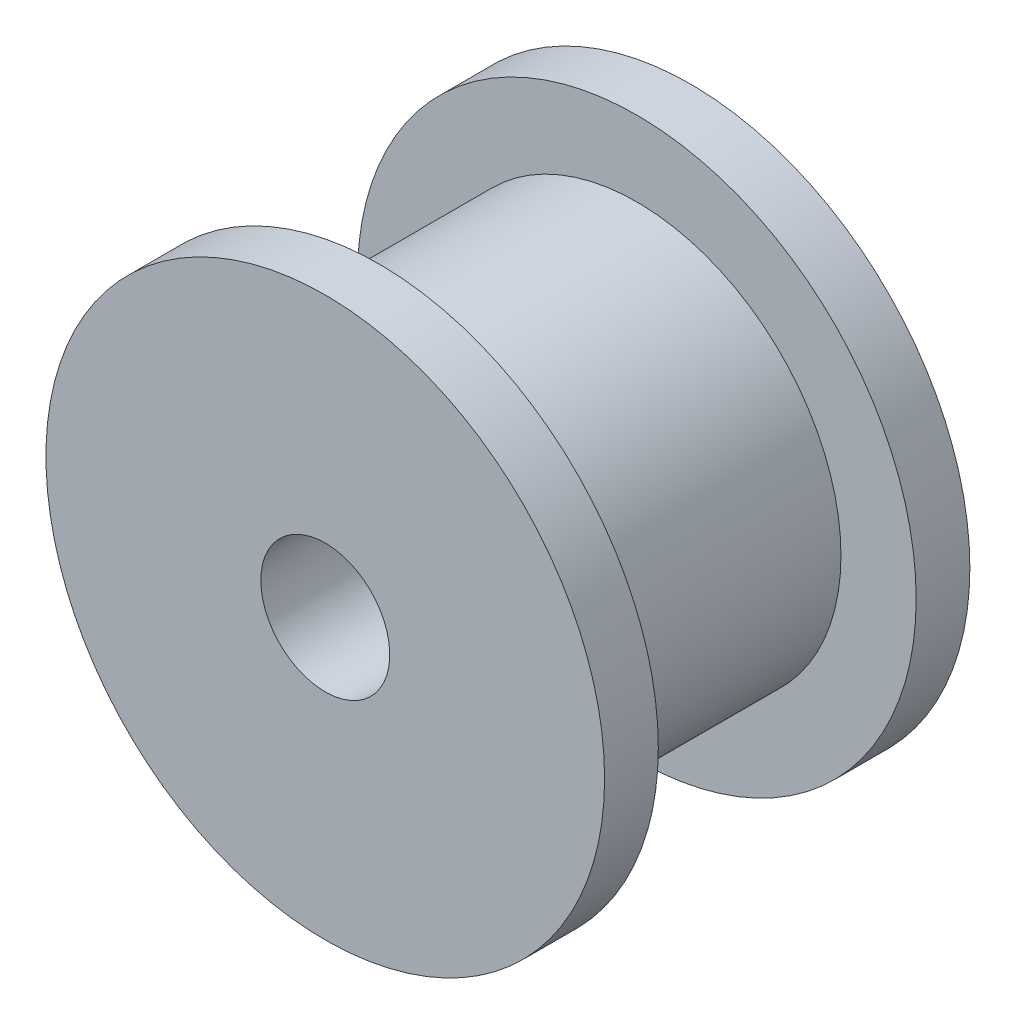
ISO-10303-21;
HEADER;
FILE_DESCRIPTION(('STEP AP214'),'2;1');
FILE_NAME('part.step','',(''),(''),'','','');
FILE_SCHEMA(('AUTOMOTIVE_DESIGN { 1 0 10303 214 1 1 1 1 }'));
ENDSEC;
DATA;
#1=APPLICATION_CONTEXT('core data for automotive mechanical design processes');
#2=APPLICATION_PROTOCOL_DEFINITION('international standard','automotive_design',2000,#1);
#3=PRODUCT_CONTEXT('',#1,'mechanical');
#4=PRODUCT('Part','Part','',(#3));
#5=PRODUCT_RELATED_PRODUCT_CATEGORY('part','',(#4));
#6=PRODUCT_DEFINITION_FORMATION('','',#4);
#7=PRODUCT_DEFINITION_CONTEXT('part definition',#1,'design');
#8=PRODUCT_DEFINITION('design','',#6,#7);
#9=PRODUCT_DEFINITION_SHAPE('','',#8);
#10=(LENGTH_UNIT() NAMED_UNIT(*) SI_UNIT(.MILLI.,.METRE.));
#11=(NAMED_UNIT(*) PLANE_ANGLE_UNIT() SI_UNIT($,.RADIAN.));
#12=(NAMED_UNIT(*) SI_UNIT($,.STERADIAN.) SOLID_ANGLE_UNIT());
#13=UNCERTAINTY_MEASURE_WITH_UNIT(LENGTH_MEASURE(1.E-05),#10,'distance_accuracy_value','');
#14=(GEOMETRIC_REPRESENTATION_CONTEXT(3) GLOBAL_UNCERTAINTY_ASSIGNED_CONTEXT((#13)) GLOBAL_UNIT_ASSIGNED_CONTEXT((#10,
#11,#12)) REPRESENTATION_CONTEXT('',''));
#15=CARTESIAN_POINT('',(0.,0.,0.));
#16=DIRECTION('',(0.,0.,1.));
#17=DIRECTION('',(1.,0.,0.));
#18=AXIS2_PLACEMENT_3D('',#15,#16,#17);
#19=CARTESIAN_POINT('',(0.,0.,1.25));
#20=DIRECTION('',(0.,0.,-1.));
#21=DIRECTION('',(-1.,0.,0.));
#22=AXIS2_PLACEMENT_3D('',#19,#20,#21);
#23=CYLINDRICAL_SURFACE('',#22,6.5);
#24=CARTESIAN_POINT('',(0.,0.,1.25));
#25=DIRECTION('',(0.,0.,1.));
#26=DIRECTION('',(1.,0.,0.));
#27=AXIS2_PLACEMENT_3D('',#24,#25,#26);
#28=CIRCLE('',#27,6.5);
#29=CARTESIAN_POINT('',(6.5,0.,1.25));
#30=VERTEX_POINT('',#29);
#31=EDGE_CURVE('E44',#30,#30,#28,.T.);
#32=ORIENTED_EDGE('',*,*,#31,.F.);
#33=EDGE_LOOP('',(#32));
#34=FACE_BOUND('',#33,.T.);
#35=CARTESIAN_POINT('',(0.,0.,0.));
#36=DIRECTION('',(0.,0.,1.));
#37=DIRECTION('',(1.,0.,0.));
#38=AXIS2_PLACEMENT_3D('',#35,#36,#37);
#39=CIRCLE('',#38,6.5);
#40=CARTESIAN_POINT('',(6.5,0.,0.));
#41=VERTEX_POINT('',#40);
#42=EDGE_CURVE('E39',#41,#41,#39,.T.);
#43=ORIENTED_EDGE('',*,*,#42,.T.);
#44=EDGE_LOOP('',(#43));
#45=FACE_BOUND('',#44,.T.);
#46=ADVANCED_FACE('F36',(#34,#45),#23,.T.);
#47=CARTESIAN_POINT('',(0.,0.,1.25));
#48=DIRECTION('',(0.,0.,1.));
#49=DIRECTION('',(1.,0.,0.));
#50=AXIS2_PLACEMENT_3D('',#47,#48,#49);
#51=PLANE('',#50);
#52=CARTESIAN_POINT('',(0.,0.,1.25));
#53=DIRECTION('',(0.,0.,1.));
#54=DIRECTION('',(1.,0.,0.));
#55=AXIS2_PLACEMENT_3D('',#52,#53,#54);
#56=CIRCLE('',#55,4.75);
#57=CARTESIAN_POINT('',(4.75,0.,1.25));
#58=VERTEX_POINT('',#57);
#59=EDGE_CURVE('E10',#58,#58,#56,.T.);
#60=ORIENTED_EDGE('',*,*,#59,.F.);
#61=EDGE_LOOP('',(#60));
#62=FACE_BOUND('',#61,.T.);
#63=ORIENTED_EDGE('',*,*,#31,.T.);
#64=EDGE_LOOP('',(#63));
#65=FACE_BOUND('',#64,.T.);
#66=ADVANCED_FACE('F86',(#62,#65),#51,.T.);
#67=CARTESIAN_POINT('',(0.,0.,0.));
#68=DIRECTION('',(0.,0.,1.));
#69=DIRECTION('',(1.,0.,0.));
#70=AXIS2_PLACEMENT_3D('',#67,#68,#69);
#71=PLANE('',#70);
#72=CARTESIAN_POINT('',(0.,0.,0.));
#73=DIRECTION('',(0.,0.,-1.));
#74=DIRECTION('',(-1.,0.,0.));
#75=AXIS2_PLACEMENT_3D('',#72,#73,#74);
#76=CIRCLE('',#75,1.5);
#77=CARTESIAN_POINT('',(-1.5,0.,0.));
#78=VERTEX_POINT('',#77);
#79=EDGE_CURVE('E64',#78,#78,#76,.T.);
#80=ORIENTED_EDGE('',*,*,#79,.F.);
#81=EDGE_LOOP('',(#80));
#82=FACE_BOUND('',#81,.T.);
#83=ORIENTED_EDGE('',*,*,#42,.F.);
#84=EDGE_LOOP('',(#83));
#85=FACE_BOUND('',#84,.T.);
#86=ADVANCED_FACE('F82',(#82,#85),#71,.F.);
#87=CARTESIAN_POINT('',(0.,0.,7.25));
#88=DIRECTION('',(0.,0.,-1.));
#89=DIRECTION('',(-1.,0.,0.));
#90=AXIS2_PLACEMENT_3D('',#87,#88,#89);
#91=CYLINDRICAL_SURFACE('',#90,4.75);
#92=CARTESIAN_POINT('',(0.,0.,7.25));
#93=DIRECTION('',(0.,0.,1.));
#94=DIRECTION('',(1.,0.,0.));
#95=AXIS2_PLACEMENT_3D('',#92,#93,#94);
#96=CIRCLE('',#95,4.75);
#97=CARTESIAN_POINT('',(4.75,0.,7.25));
#98=VERTEX_POINT('',#97);
#99=EDGE_CURVE('E51',#98,#98,#96,.T.);
#100=ORIENTED_EDGE('',*,*,#99,.F.);
#101=EDGE_LOOP('',(#100));
#102=FACE_BOUND('',#101,.T.);
#103=ORIENTED_EDGE('',*,*,#59,.T.);
#104=EDGE_LOOP('',(#103));
#105=FACE_BOUND('',#104,.T.);
#106=ADVANCED_FACE('F85',(#102,#105),#91,.T.);
#107=CARTESIAN_POINT('',(0.,0.,8.5));
#108=DIRECTION('',(0.,0.,-1.));
#109=DIRECTION('',(-1.,0.,0.));
#110=AXIS2_PLACEMENT_3D('',#107,#108,#109);
#111=CYLINDRICAL_SURFACE('',#110,6.5);
#112=CARTESIAN_POINT('',(0.,0.,8.5));
#113=DIRECTION('',(0.,0.,1.));
#114=DIRECTION('',(1.,0.,0.));
#115=AXIS2_PLACEMENT_3D('',#112,#113,#114);
#116=CIRCLE('',#115,6.5);
#117=CARTESIAN_POINT('',(6.5,0.,8.5));
#118=VERTEX_POINT('',#117);
#119=EDGE_CURVE('E55',#118,#118,#116,.T.);
#120=ORIENTED_EDGE('',*,*,#119,.F.);
#121=EDGE_LOOP('',(#120));
#122=FACE_BOUND('',#121,.T.);
#123=CARTESIAN_POINT('',(0.,0.,7.25));
#124=DIRECTION('',(0.,0.,1.));
#125=DIRECTION('',(1.,0.,0.));
#126=AXIS2_PLACEMENT_3D('',#123,#124,#125);
#127=CIRCLE('',#126,6.5);
#128=CARTESIAN_POINT('',(6.5,0.,7.25));
#129=VERTEX_POINT('',#128);
#130=EDGE_CURVE('E56',#129,#129,#127,.T.);
#131=ORIENTED_EDGE('',*,*,#130,.T.);
#132=EDGE_LOOP('',(#131));
#133=FACE_BOUND('',#132,.T.);
#134=ADVANCED_FACE('F106',(#122,#133),#111,.T.);
#135=CARTESIAN_POINT('',(0.,0.,8.5));
#136=DIRECTION('',(0.,0.,1.));
#137=DIRECTION('',(1.,0.,0.));
#138=AXIS2_PLACEMENT_3D('',#135,#136,#137);
#139=PLANE('',#138);
#140=CARTESIAN_POINT('',(0.,0.,8.5));
#141=DIRECTION('',(0.,0.,-1.));
#142=DIRECTION('',(-1.,0.,0.));
#143=AXIS2_PLACEMENT_3D('',#140,#141,#142);
#144=CIRCLE('',#143,1.5);
#145=CARTESIAN_POINT('',(-1.5,0.,8.5));
#146=VERTEX_POINT('',#145);
#147=EDGE_CURVE('E60',#146,#146,#144,.T.);
#148=ORIENTED_EDGE('',*,*,#147,.T.);
#149=EDGE_LOOP('',(#148));
#150=FACE_BOUND('',#149,.T.);
#151=ORIENTED_EDGE('',*,*,#119,.T.);
#152=EDGE_LOOP('',(#151));
#153=FACE_BOUND('',#152,.T.);
#154=ADVANCED_FACE('F72',(#150,#153),#139,.T.);
#155=CARTESIAN_POINT('',(0.,0.,7.25));
#156=DIRECTION('',(0.,0.,1.));
#157=DIRECTION('',(1.,0.,0.));
#158=AXIS2_PLACEMENT_3D('',#155,#156,#157);
#159=PLANE('',#158);
#160=ORIENTED_EDGE('',*,*,#99,.T.);
#161=EDGE_LOOP('',(#160));
#162=FACE_BOUND('',#161,.T.);
#163=ORIENTED_EDGE('',*,*,#130,.F.);
#164=EDGE_LOOP('',(#163));
#165=FACE_BOUND('',#164,.T.);
#166=ADVANCED_FACE('F78',(#162,#165),#159,.F.);
#167=CARTESIAN_POINT('',(0.,0.,8.5));
#168=DIRECTION('',(0.,0.,-1.));
#169=DIRECTION('',(-1.,0.,0.));
#170=AXIS2_PLACEMENT_3D('',#167,#168,#169);
#171=CYLINDRICAL_SURFACE('',#170,1.5);
#172=ORIENTED_EDGE('',*,*,#147,.F.);
#173=EDGE_LOOP('',(#172));
#174=FACE_BOUND('',#173,.T.);
#175=ORIENTED_EDGE('',*,*,#79,.T.);
#176=EDGE_LOOP('',(#175));
#177=FACE_BOUND('',#176,.T.);
#178=ADVANCED_FACE('F75',(#174,#177),#171,.F.);
#179=CLOSED_SHELL('',(#46,#66,#86,#106,#134,#154,#166,#178));
#180=MANIFOLD_SOLID_BREP('B2',#179);
#181=ADVANCED_BREP_SHAPE_REPRESENTATION('',(#18,#180),#14);
#182=SHAPE_DEFINITION_REPRESENTATION(#9,#181);
ENDSEC;
END-ISO-10303-21;
